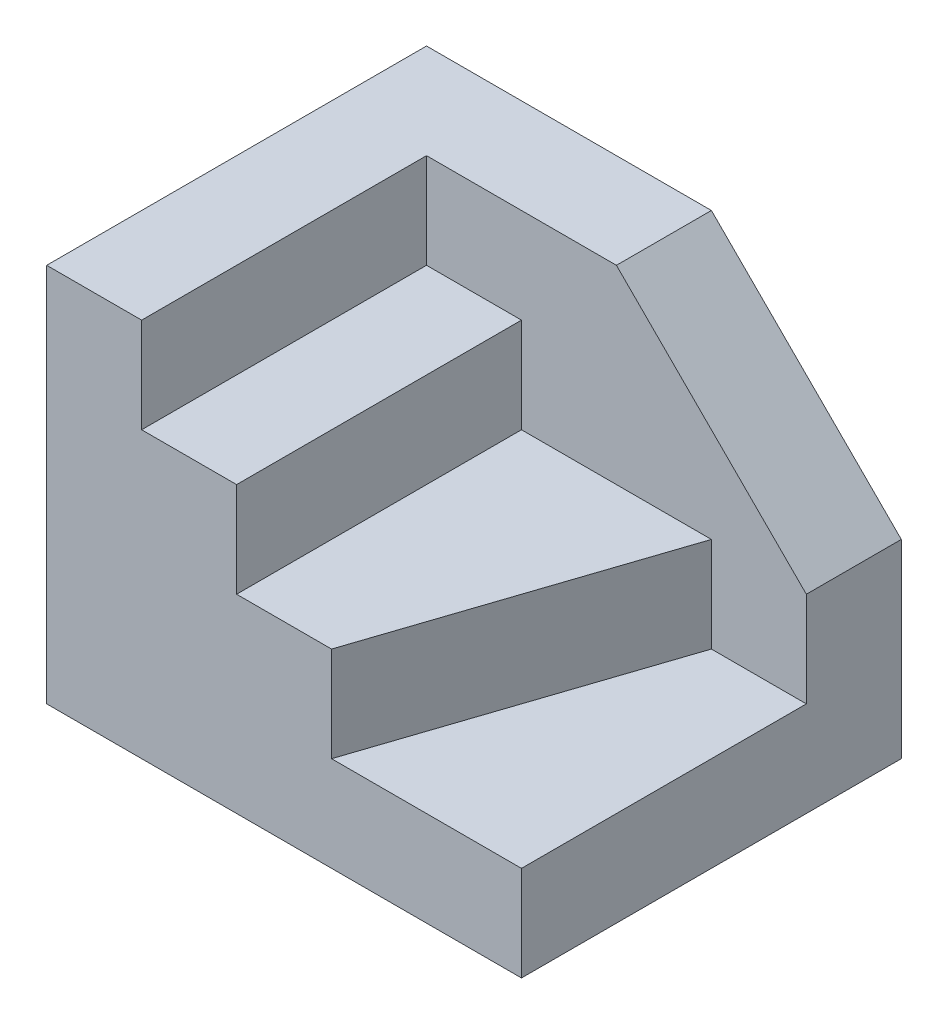
ISO-10303-21;
HEADER;
FILE_DESCRIPTION(('STEP AP214'),'2;1');
FILE_NAME('part.step','',(''),(''),'','','');
FILE_SCHEMA(('AUTOMOTIVE_DESIGN { 1 0 10303 214 1 1 1 1 }'));
ENDSEC;
DATA;
#1=APPLICATION_CONTEXT('core data for automotive mechanical design processes');
#2=APPLICATION_PROTOCOL_DEFINITION('international standard','automotive_design',2000,#1);
#3=PRODUCT_CONTEXT('',#1,'mechanical');
#4=PRODUCT('Part','Part','',(#3));
#5=PRODUCT_RELATED_PRODUCT_CATEGORY('part','',(#4));
#6=PRODUCT_DEFINITION_FORMATION('','',#4);
#7=PRODUCT_DEFINITION_CONTEXT('part definition',#1,'design');
#8=PRODUCT_DEFINITION('design','',#6,#7);
#9=PRODUCT_DEFINITION_SHAPE('','',#8);
#10=(LENGTH_UNIT() NAMED_UNIT(*) SI_UNIT(.MILLI.,.METRE.));
#11=(NAMED_UNIT(*) PLANE_ANGLE_UNIT() SI_UNIT($,.RADIAN.));
#12=(NAMED_UNIT(*) SI_UNIT($,.STERADIAN.) SOLID_ANGLE_UNIT());
#13=UNCERTAINTY_MEASURE_WITH_UNIT(LENGTH_MEASURE(1.E-05),#10,'distance_accuracy_value','');
#14=(GEOMETRIC_REPRESENTATION_CONTEXT(3) GLOBAL_UNCERTAINTY_ASSIGNED_CONTEXT((#13)) GLOBAL_UNIT_ASSIGNED_CONTEXT((#10,
#11,#12)) REPRESENTATION_CONTEXT('',''));
#15=CARTESIAN_POINT('',(0.,0.,0.));
#16=DIRECTION('',(0.,0.,1.));
#17=DIRECTION('',(1.,0.,0.));
#18=AXIS2_PLACEMENT_3D('',#15,#16,#17);
#19=CARTESIAN_POINT('',(0.,40.,-30.));
#20=DIRECTION('',(0.,0.,-1.));
#21=DIRECTION('',(-1.,0.,0.));
#22=AXIS2_PLACEMENT_3D('',#19,#20,#21);
#23=PLANE('',#22);
#24=DIRECTION('',(-0.707106781186549,0.707106781186546,0.));
#25=VECTOR('',#24,1.);
#26=CARTESIAN_POINT('',(30.,40.,-30.));
#27=LINE('',#26,#25);
#28=CARTESIAN_POINT('',(50.,20.0000000000001,-30.));
#29=VERTEX_POINT('',#28);
#30=CARTESIAN_POINT('',(30.,40.,-30.));
#31=VERTEX_POINT('',#30);
#32=EDGE_CURVE('E123',#29,#31,#27,.T.);
#33=ORIENTED_EDGE('',*,*,#32,.T.);
#34=DIRECTION('',(1.,0.,0.));
#35=VECTOR('',#34,1.);
#36=CARTESIAN_POINT('',(0.,40.,-30.));
#37=LINE('',#36,#35);
#38=CARTESIAN_POINT('',(10.,40.,-30.));
#39=VERTEX_POINT('',#38);
#40=EDGE_CURVE('E133',#39,#31,#37,.T.);
#41=ORIENTED_EDGE('',*,*,#40,.F.);
#42=DIRECTION('',(0.,-1.,0.));
#43=VECTOR('',#42,1.);
#44=CARTESIAN_POINT('',(10.,40.,-30.));
#45=LINE('',#44,#43);
#46=CARTESIAN_POINT('',(10.,30.,-30.));
#47=VERTEX_POINT('',#46);
#48=EDGE_CURVE('E11',#39,#47,#45,.T.);
#49=ORIENTED_EDGE('',*,*,#48,.T.);
#50=DIRECTION('',(1.,0.,0.));
#51=VECTOR('',#50,1.);
#52=CARTESIAN_POINT('',(0.,30.,-30.));
#53=LINE('',#52,#51);
#54=CARTESIAN_POINT('',(20.,30.,-30.));
#55=VERTEX_POINT('',#54);
#56=EDGE_CURVE('E55',#47,#55,#53,.T.);
#57=ORIENTED_EDGE('',*,*,#56,.T.);
#58=DIRECTION('',(0.,-1.,0.));
#59=VECTOR('',#58,1.);
#60=CARTESIAN_POINT('',(20.,30.,-30.));
#61=LINE('',#60,#59);
#62=CARTESIAN_POINT('',(20.,20.,-30.));
#63=VERTEX_POINT('',#62);
#64=EDGE_CURVE('E159',#55,#63,#61,.T.);
#65=ORIENTED_EDGE('',*,*,#64,.T.);
#66=DIRECTION('',(1.,0.,0.));
#67=VECTOR('',#66,1.);
#68=CARTESIAN_POINT('',(0.,20.,-30.));
#69=LINE('',#68,#67);
#70=CARTESIAN_POINT('',(40.,20.,-30.));
#71=VERTEX_POINT('',#70);
#72=EDGE_CURVE('E201',#63,#71,#69,.T.);
#73=ORIENTED_EDGE('',*,*,#72,.T.);
#74=DIRECTION('',(0.,-1.,0.));
#75=VECTOR('',#74,1.);
#76=CARTESIAN_POINT('',(40.,20.,-30.));
#77=LINE('',#76,#75);
#78=CARTESIAN_POINT('',(40.,10.,-30.));
#79=VERTEX_POINT('',#78);
#80=EDGE_CURVE('E190',#71,#79,#77,.T.);
#81=ORIENTED_EDGE('',*,*,#80,.T.);
#82=DIRECTION('',(1.,0.,0.));
#83=VECTOR('',#82,1.);
#84=CARTESIAN_POINT('',(0.,10.,-30.));
#85=LINE('',#84,#83);
#86=CARTESIAN_POINT('',(50.,10.,-30.));
#87=VERTEX_POINT('',#86);
#88=EDGE_CURVE('E129',#79,#87,#85,.T.);
#89=ORIENTED_EDGE('',*,*,#88,.T.);
#90=DIRECTION('',(0.,-1.,0.));
#91=VECTOR('',#90,1.);
#92=CARTESIAN_POINT('',(50.,40.,-30.));
#93=LINE('',#92,#91);
#94=EDGE_CURVE('E41',#29,#87,#93,.T.);
#95=ORIENTED_EDGE('',*,*,#94,.F.);
#96=EDGE_LOOP('',(#33,#41,#49,#57,#65,#73,#81,#89,#95));
#97=FACE_BOUND('',#96,.T.);
#98=ADVANCED_FACE('F33',(#97),#23,.F.);
#99=CARTESIAN_POINT('',(50.,40.,0.));
#100=DIRECTION('',(1.,0.,0.));
#101=DIRECTION('',(0.,0.,-1.));
#102=AXIS2_PLACEMENT_3D('',#99,#100,#101);
#103=PLANE('',#102);
#104=DIRECTION('',(0.,-1.,0.));
#105=VECTOR('',#104,1.);
#106=CARTESIAN_POINT('',(50.,40.,-40.));
#107=LINE('',#106,#105);
#108=CARTESIAN_POINT('',(50.,20.0000000000001,-40.));
#109=VERTEX_POINT('',#108);
#110=CARTESIAN_POINT('',(50.,0.,-40.));
#111=VERTEX_POINT('',#110);
#112=EDGE_CURVE('E172',#109,#111,#107,.T.);
#113=ORIENTED_EDGE('',*,*,#112,.F.);
#114=DIRECTION('',(0.,0.,-1.));
#115=VECTOR('',#114,1.);
#116=CARTESIAN_POINT('',(50.,20.0000000000001,101.872930440884));
#117=LINE('',#116,#115);
#118=EDGE_CURVE('E130',#29,#109,#117,.T.);
#119=ORIENTED_EDGE('',*,*,#118,.F.);
#120=ORIENTED_EDGE('',*,*,#94,.T.);
#121=DIRECTION('',(0.,0.,1.));
#122=VECTOR('',#121,1.);
#123=CARTESIAN_POINT('',(50.,10.,0.));
#124=LINE('',#123,#122);
#125=CARTESIAN_POINT('',(50.,10.,0.));
#126=VERTEX_POINT('',#125);
#127=EDGE_CURVE('E179',#87,#126,#124,.T.);
#128=ORIENTED_EDGE('',*,*,#127,.T.);
#129=DIRECTION('',(0.,-1.,0.));
#130=VECTOR('',#129,1.);
#131=CARTESIAN_POINT('',(50.,10.,0.));
#132=LINE('',#131,#130);
#133=CARTESIAN_POINT('',(50.,0.,0.));
#134=VERTEX_POINT('',#133);
#135=EDGE_CURVE('E186',#126,#134,#132,.T.);
#136=ORIENTED_EDGE('',*,*,#135,.T.);
#137=DIRECTION('',(0.,0.,1.));
#138=VECTOR('',#137,1.);
#139=CARTESIAN_POINT('',(50.,0.,0.));
#140=LINE('',#139,#138);
#141=EDGE_CURVE('E156',#111,#134,#140,.T.);
#142=ORIENTED_EDGE('',*,*,#141,.F.);
#143=EDGE_LOOP('',(#113,#119,#120,#128,#136,#142));
#144=FACE_BOUND('',#143,.T.);
#145=ADVANCED_FACE('F177',(#144),#103,.T.);
#146=CARTESIAN_POINT('',(0.,40.,0.));
#147=DIRECTION('',(0.,1.,0.));
#148=DIRECTION('',(0.,0.,1.));
#149=AXIS2_PLACEMENT_3D('',#146,#147,#148);
#150=PLANE('',#149);
#151=ORIENTED_EDGE('',*,*,#40,.T.);
#152=DIRECTION('',(0.,0.,-1.));
#153=VECTOR('',#152,1.);
#154=CARTESIAN_POINT('',(30.,40.,101.872930440884));
#155=LINE('',#154,#153);
#156=CARTESIAN_POINT('',(30.,40.,-40.));
#157=VERTEX_POINT('',#156);
#158=EDGE_CURVE('E120',#31,#157,#155,.T.);
#159=ORIENTED_EDGE('',*,*,#158,.T.);
#160=DIRECTION('',(1.,0.,0.));
#161=VECTOR('',#160,1.);
#162=CARTESIAN_POINT('',(0.,40.,-40.));
#163=LINE('',#162,#161);
#164=CARTESIAN_POINT('',(0.,40.,-40.));
#165=VERTEX_POINT('',#164);
#166=EDGE_CURVE('E142',#165,#157,#163,.T.);
#167=ORIENTED_EDGE('',*,*,#166,.F.);
#168=DIRECTION('',(0.,0.,-1.));
#169=VECTOR('',#168,1.);
#170=CARTESIAN_POINT('',(0.,40.,0.));
#171=LINE('',#170,#169);
#172=CARTESIAN_POINT('',(0.,40.,0.));
#173=VERTEX_POINT('',#172);
#174=EDGE_CURVE('E144',#173,#165,#171,.T.);
#175=ORIENTED_EDGE('',*,*,#174,.F.);
#176=DIRECTION('',(-1.,0.,0.));
#177=VECTOR('',#176,1.);
#178=CARTESIAN_POINT('',(0.,40.,0.));
#179=LINE('',#178,#177);
#180=CARTESIAN_POINT('',(10.,40.,0.));
#181=VERTEX_POINT('',#180);
#182=EDGE_CURVE('E152',#181,#173,#179,.T.);
#183=ORIENTED_EDGE('',*,*,#182,.F.);
#184=DIRECTION('',(0.,0.,-1.));
#185=VECTOR('',#184,1.);
#186=CARTESIAN_POINT('',(10.,40.,0.));
#187=LINE('',#186,#185);
#188=EDGE_CURVE('E140',#181,#39,#187,.T.);
#189=ORIENTED_EDGE('',*,*,#188,.T.);
#190=EDGE_LOOP('',(#151,#159,#167,#175,#183,#189));
#191=FACE_BOUND('',#190,.T.);
#192=ADVANCED_FACE('F137',(#191),#150,.T.);
#193=CARTESIAN_POINT('',(10.,40.,0.));
#194=DIRECTION('',(-1.,0.,0.));
#195=DIRECTION('',(0.,0.,1.));
#196=AXIS2_PLACEMENT_3D('',#193,#194,#195);
#197=PLANE('',#196);
#198=DIRECTION('',(0.,-1.,0.));
#199=VECTOR('',#198,1.);
#200=CARTESIAN_POINT('',(10.,40.,0.));
#201=LINE('',#200,#199);
#202=CARTESIAN_POINT('',(10.,30.,0.));
#203=VERTEX_POINT('',#202);
#204=EDGE_CURVE('E155',#181,#203,#201,.T.);
#205=ORIENTED_EDGE('',*,*,#204,.T.);
#206=DIRECTION('',(0.,0.,-1.));
#207=VECTOR('',#206,1.);
#208=CARTESIAN_POINT('',(10.,30.,0.));
#209=LINE('',#208,#207);
#210=EDGE_CURVE('E216',#203,#47,#209,.T.);
#211=ORIENTED_EDGE('',*,*,#210,.T.);
#212=ORIENTED_EDGE('',*,*,#48,.F.);
#213=ORIENTED_EDGE('',*,*,#188,.F.);
#214=EDGE_LOOP('',(#205,#211,#212,#213));
#215=FACE_BOUND('',#214,.T.);
#216=ADVANCED_FACE('F35',(#215),#197,.F.);
#217=CARTESIAN_POINT('',(0.,40.,-40.));
#218=DIRECTION('',(0.,0.,-1.));
#219=DIRECTION('',(-1.,0.,0.));
#220=AXIS2_PLACEMENT_3D('',#217,#218,#219);
#221=PLANE('',#220);
#222=DIRECTION('',(-0.707106781186549,0.707106781186546,0.));
#223=VECTOR('',#222,1.);
#224=CARTESIAN_POINT('',(30.,40.,-40.));
#225=LINE('',#224,#223);
#226=EDGE_CURVE('E48',#109,#157,#225,.T.);
#227=ORIENTED_EDGE('',*,*,#226,.F.);
#228=ORIENTED_EDGE('',*,*,#112,.T.);
#229=DIRECTION('',(1.,0.,0.));
#230=VECTOR('',#229,1.);
#231=CARTESIAN_POINT('',(0.,0.,-40.));
#232=LINE('',#231,#230);
#233=CARTESIAN_POINT('',(0.,0.,-40.));
#234=VERTEX_POINT('',#233);
#235=EDGE_CURVE('E158',#234,#111,#232,.T.);
#236=ORIENTED_EDGE('',*,*,#235,.F.);
#237=DIRECTION('',(0.,-1.,0.));
#238=VECTOR('',#237,1.);
#239=CARTESIAN_POINT('',(0.,40.,-40.));
#240=LINE('',#239,#238);
#241=EDGE_CURVE('E170',#165,#234,#240,.T.);
#242=ORIENTED_EDGE('',*,*,#241,.F.);
#243=ORIENTED_EDGE('',*,*,#166,.T.);
#244=EDGE_LOOP('',(#227,#228,#236,#242,#243));
#245=FACE_BOUND('',#244,.T.);
#246=ADVANCED_FACE('F246',(#245),#221,.T.);
#247=CARTESIAN_POINT('',(0.,40.,0.));
#248=DIRECTION('',(-1.,0.,0.));
#249=DIRECTION('',(0.,0.,1.));
#250=AXIS2_PLACEMENT_3D('',#247,#248,#249);
#251=PLANE('',#250);
#252=DIRECTION('',(0.,0.,-1.));
#253=VECTOR('',#252,1.);
#254=CARTESIAN_POINT('',(0.,0.,0.));
#255=LINE('',#254,#253);
#256=CARTESIAN_POINT('',(0.,0.,0.));
#257=VERTEX_POINT('',#256);
#258=EDGE_CURVE('E162',#257,#234,#255,.T.);
#259=ORIENTED_EDGE('',*,*,#258,.F.);
#260=DIRECTION('',(0.,-1.,0.));
#261=VECTOR('',#260,1.);
#262=CARTESIAN_POINT('',(0.,40.,0.));
#263=LINE('',#262,#261);
#264=EDGE_CURVE('E168',#173,#257,#263,.T.);
#265=ORIENTED_EDGE('',*,*,#264,.F.);
#266=ORIENTED_EDGE('',*,*,#174,.T.);
#267=ORIENTED_EDGE('',*,*,#241,.T.);
#268=EDGE_LOOP('',(#259,#265,#266,#267));
#269=FACE_BOUND('',#268,.T.);
#270=ADVANCED_FACE('F250',(#269),#251,.T.);
#271=CARTESIAN_POINT('',(0.,40.,0.));
#272=DIRECTION('',(0.,0.,1.));
#273=DIRECTION('',(1.,0.,0.));
#274=AXIS2_PLACEMENT_3D('',#271,#272,#273);
#275=PLANE('',#274);
#276=DIRECTION('',(-1.,0.,0.));
#277=VECTOR('',#276,1.);
#278=CARTESIAN_POINT('',(0.,0.,0.));
#279=LINE('',#278,#277);
#280=EDGE_CURVE('E146',#134,#257,#279,.T.);
#281=ORIENTED_EDGE('',*,*,#280,.F.);
#282=ORIENTED_EDGE('',*,*,#135,.F.);
#283=DIRECTION('',(-1.,0.,0.));
#284=VECTOR('',#283,1.);
#285=CARTESIAN_POINT('',(0.,10.,0.));
#286=LINE('',#285,#284);
#287=CARTESIAN_POINT('',(30.,10.,0.));
#288=VERTEX_POINT('',#287);
#289=EDGE_CURVE('E185',#126,#288,#286,.T.);
#290=ORIENTED_EDGE('',*,*,#289,.T.);
#291=DIRECTION('',(0.,-1.,0.));
#292=VECTOR('',#291,1.);
#293=CARTESIAN_POINT('',(30.,20.,0.));
#294=LINE('',#293,#292);
#295=CARTESIAN_POINT('',(30.,20.,0.));
#296=VERTEX_POINT('',#295);
#297=EDGE_CURVE('E208',#296,#288,#294,.T.);
#298=ORIENTED_EDGE('',*,*,#297,.F.);
#299=DIRECTION('',(-1.,0.,0.));
#300=VECTOR('',#299,1.);
#301=CARTESIAN_POINT('',(0.,20.,0.));
#302=LINE('',#301,#300);
#303=CARTESIAN_POINT('',(20.,20.,0.));
#304=VERTEX_POINT('',#303);
#305=EDGE_CURVE('E205',#296,#304,#302,.T.);
#306=ORIENTED_EDGE('',*,*,#305,.T.);
#307=DIRECTION('',(0.,-1.,0.));
#308=VECTOR('',#307,1.);
#309=CARTESIAN_POINT('',(20.,30.,0.));
#310=LINE('',#309,#308);
#311=CARTESIAN_POINT('',(20.,30.,0.));
#312=VERTEX_POINT('',#311);
#313=EDGE_CURVE('E221',#312,#304,#310,.T.);
#314=ORIENTED_EDGE('',*,*,#313,.F.);
#315=DIRECTION('',(-1.,0.,0.));
#316=VECTOR('',#315,1.);
#317=CARTESIAN_POINT('',(0.,30.,0.));
#318=LINE('',#317,#316);
#319=EDGE_CURVE('E218',#312,#203,#318,.T.);
#320=ORIENTED_EDGE('',*,*,#319,.T.);
#321=ORIENTED_EDGE('',*,*,#204,.F.);
#322=ORIENTED_EDGE('',*,*,#182,.T.);
#323=ORIENTED_EDGE('',*,*,#264,.T.);
#324=EDGE_LOOP('',(#281,#282,#290,#298,#306,#314,#320,#321,#322,#323));
#325=FACE_BOUND('',#324,.T.);
#326=ADVANCED_FACE('F233',(#325),#275,.T.);
#327=CARTESIAN_POINT('',(0.,0.,0.));
#328=DIRECTION('',(0.,1.,0.));
#329=DIRECTION('',(0.,0.,1.));
#330=AXIS2_PLACEMENT_3D('',#327,#328,#329);
#331=PLANE('',#330);
#332=ORIENTED_EDGE('',*,*,#141,.T.);
#333=ORIENTED_EDGE('',*,*,#280,.T.);
#334=ORIENTED_EDGE('',*,*,#258,.T.);
#335=ORIENTED_EDGE('',*,*,#235,.T.);
#336=EDGE_LOOP('',(#332,#333,#334,#335));
#337=FACE_BOUND('',#336,.T.);
#338=ADVANCED_FACE('F243',(#337),#331,.F.);
#339=CARTESIAN_POINT('',(20.,30.,0.));
#340=DIRECTION('',(1.,0.,0.));
#341=DIRECTION('',(0.,0.,-1.));
#342=AXIS2_PLACEMENT_3D('',#339,#340,#341);
#343=PLANE('',#342);
#344=DIRECTION('',(0.,0.,1.));
#345=VECTOR('',#344,1.);
#346=CARTESIAN_POINT('',(20.,20.,0.));
#347=LINE('',#346,#345);
#348=EDGE_CURVE('E203',#63,#304,#347,.T.);
#349=ORIENTED_EDGE('',*,*,#348,.F.);
#350=ORIENTED_EDGE('',*,*,#64,.F.);
#351=DIRECTION('',(0.,0.,1.));
#352=VECTOR('',#351,1.);
#353=CARTESIAN_POINT('',(20.,30.,0.));
#354=LINE('',#353,#352);
#355=EDGE_CURVE('E212',#55,#312,#354,.T.);
#356=ORIENTED_EDGE('',*,*,#355,.T.);
#357=ORIENTED_EDGE('',*,*,#313,.T.);
#358=EDGE_LOOP('',(#349,#350,#356,#357));
#359=FACE_BOUND('',#358,.T.);
#360=ADVANCED_FACE('F226',(#359),#343,.T.);
#361=CARTESIAN_POINT('',(0.,30.,0.));
#362=DIRECTION('',(0.,1.,0.));
#363=DIRECTION('',(0.,0.,1.));
#364=AXIS2_PLACEMENT_3D('',#361,#362,#363);
#365=PLANE('',#364);
#366=ORIENTED_EDGE('',*,*,#355,.F.);
#367=ORIENTED_EDGE('',*,*,#56,.F.);
#368=ORIENTED_EDGE('',*,*,#210,.F.);
#369=ORIENTED_EDGE('',*,*,#319,.F.);
#370=EDGE_LOOP('',(#366,#367,#368,#369));
#371=FACE_BOUND('',#370,.T.);
#372=ADVANCED_FACE('F229',(#371),#365,.T.);
#373=CARTESIAN_POINT('',(27.,20.,9.));
#374=DIRECTION('',(0.948683298050514,0.,0.316227766016838));
#375=DIRECTION('',(0.316227766016838,0.,-0.948683298050514));
#376=AXIS2_PLACEMENT_3D('',#373,#374,#375);
#377=PLANE('',#376);
#378=DIRECTION('',(-0.316227766016838,0.,0.948683298050514));
#379=VECTOR('',#378,1.);
#380=CARTESIAN_POINT('',(27.,10.,9.));
#381=LINE('',#380,#379);
#382=EDGE_CURVE('E191',#79,#288,#381,.T.);
#383=ORIENTED_EDGE('',*,*,#382,.F.);
#384=ORIENTED_EDGE('',*,*,#80,.F.);
#385=DIRECTION('',(-0.316227766016838,0.,0.948683298050514));
#386=VECTOR('',#385,1.);
#387=CARTESIAN_POINT('',(27.,20.,9.));
#388=LINE('',#387,#386);
#389=EDGE_CURVE('E198',#71,#296,#388,.T.);
#390=ORIENTED_EDGE('',*,*,#389,.T.);
#391=ORIENTED_EDGE('',*,*,#297,.T.);
#392=EDGE_LOOP('',(#383,#384,#390,#391));
#393=FACE_BOUND('',#392,.T.);
#394=ADVANCED_FACE('F239',(#393),#377,.T.);
#395=CARTESIAN_POINT('',(0.,20.,0.));
#396=DIRECTION('',(0.,1.,0.));
#397=DIRECTION('',(0.,0.,1.));
#398=AXIS2_PLACEMENT_3D('',#395,#396,#397);
#399=PLANE('',#398);
#400=ORIENTED_EDGE('',*,*,#389,.F.);
#401=ORIENTED_EDGE('',*,*,#72,.F.);
#402=ORIENTED_EDGE('',*,*,#348,.T.);
#403=ORIENTED_EDGE('',*,*,#305,.F.);
#404=EDGE_LOOP('',(#400,#401,#402,#403));
#405=FACE_BOUND('',#404,.T.);
#406=ADVANCED_FACE('F237',(#405),#399,.T.);
#407=CARTESIAN_POINT('',(0.,10.,0.));
#408=DIRECTION('',(0.,1.,0.));
#409=DIRECTION('',(0.,0.,1.));
#410=AXIS2_PLACEMENT_3D('',#407,#408,#409);
#411=PLANE('',#410);
#412=ORIENTED_EDGE('',*,*,#88,.F.);
#413=ORIENTED_EDGE('',*,*,#382,.T.);
#414=ORIENTED_EDGE('',*,*,#289,.F.);
#415=ORIENTED_EDGE('',*,*,#127,.F.);
#416=EDGE_LOOP('',(#412,#413,#414,#415));
#417=FACE_BOUND('',#416,.T.);
#418=ADVANCED_FACE('F182',(#417),#411,.T.);
#419=CARTESIAN_POINT('',(30.,40.,101.872930440884));
#420=DIRECTION('',(0.707106781186546,0.707106781186549,0.));
#421=DIRECTION('',(-0.707106781186549,0.707106781186546,0.));
#422=AXIS2_PLACEMENT_3D('',#419,#420,#421);
#423=PLANE('',#422);
#424=ORIENTED_EDGE('',*,*,#32,.F.);
#425=ORIENTED_EDGE('',*,*,#118,.T.);
#426=ORIENTED_EDGE('',*,*,#226,.T.);
#427=ORIENTED_EDGE('',*,*,#158,.F.);
#428=EDGE_LOOP('',(#424,#425,#426,#427));
#429=FACE_BOUND('',#428,.T.);
#430=ADVANCED_FACE('F122',(#429),#423,.T.);
#431=CLOSED_SHELL('',(#98,#145,#192,#216,#246,#270,#326,#338,#360,#372,#394,#406,#418,#430));
#432=MANIFOLD_SOLID_BREP('B2',#431);
#433=ADVANCED_BREP_SHAPE_REPRESENTATION('',(#18,#432),#14);
#434=SHAPE_DEFINITION_REPRESENTATION(#9,#433);
ENDSEC;
END-ISO-10303-21;
